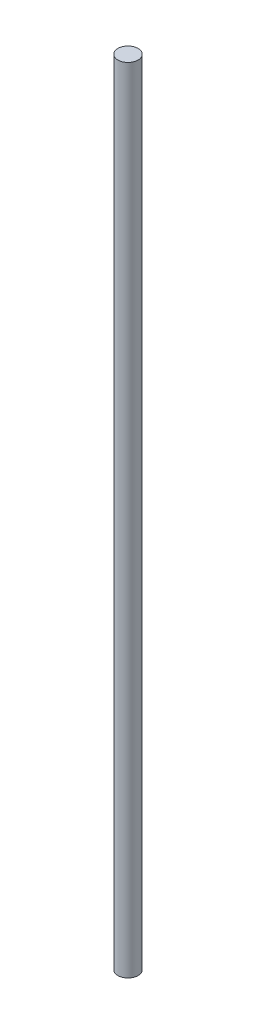
ISO-10303-21;
HEADER;
FILE_DESCRIPTION(('STEP AP214'),'2;1');
FILE_NAME('part.step','',(''),(''),'','','');
FILE_SCHEMA(('AUTOMOTIVE_DESIGN { 1 0 10303 214 1 1 1 1 }'));
ENDSEC;
DATA;
#1=APPLICATION_CONTEXT('core data for automotive mechanical design processes');
#2=APPLICATION_PROTOCOL_DEFINITION('international standard','automotive_design',2000,#1);
#3=PRODUCT_CONTEXT('',#1,'mechanical');
#4=PRODUCT('Part','Part','',(#3));
#5=PRODUCT_RELATED_PRODUCT_CATEGORY('part','',(#4));
#6=PRODUCT_DEFINITION_FORMATION('','',#4);
#7=PRODUCT_DEFINITION_CONTEXT('part definition',#1,'design');
#8=PRODUCT_DEFINITION('design','',#6,#7);
#9=PRODUCT_DEFINITION_SHAPE('','',#8);
#10=(LENGTH_UNIT() NAMED_UNIT(*) SI_UNIT(.MILLI.,.METRE.));
#11=(NAMED_UNIT(*) PLANE_ANGLE_UNIT() SI_UNIT($,.RADIAN.));
#12=(NAMED_UNIT(*) SI_UNIT($,.STERADIAN.) SOLID_ANGLE_UNIT());
#13=UNCERTAINTY_MEASURE_WITH_UNIT(LENGTH_MEASURE(1.E-05),#10,'distance_accuracy_value','');
#14=(GEOMETRIC_REPRESENTATION_CONTEXT(3) GLOBAL_UNCERTAINTY_ASSIGNED_CONTEXT((#13)) GLOBAL_UNIT_ASSIGNED_CONTEXT((#10,
#11,#12)) REPRESENTATION_CONTEXT('',''));
#15=CARTESIAN_POINT('',(0.,0.,0.));
#16=DIRECTION('',(0.,0.,1.));
#17=DIRECTION('',(1.,0.,0.));
#18=AXIS2_PLACEMENT_3D('',#15,#16,#17);
#19=CARTESIAN_POINT('',(0.,374.65,0.));
#20=DIRECTION('',(0.,-1.,0.));
#21=DIRECTION('',(0.,0.,-1.));
#22=AXIS2_PLACEMENT_3D('',#19,#20,#21);
#23=CYLINDRICAL_SURFACE('',#22,4.7625);
#24=CARTESIAN_POINT('',(0.,374.65,0.));
#25=DIRECTION('',(0.,1.,0.));
#26=DIRECTION('',(0.,0.,1.));
#27=AXIS2_PLACEMENT_3D('',#24,#25,#26);
#28=CIRCLE('',#27,4.7625);
#29=CARTESIAN_POINT('',(0.,374.65,4.7625));
#30=VERTEX_POINT('',#29);
#31=EDGE_CURVE('E10',#30,#30,#28,.T.);
#32=ORIENTED_EDGE('',*,*,#31,.F.);
#33=EDGE_LOOP('',(#32));
#34=FACE_BOUND('',#33,.T.);
#35=CARTESIAN_POINT('',(0.,0.,0.));
#36=DIRECTION('',(0.,1.,0.));
#37=DIRECTION('',(0.,0.,1.));
#38=AXIS2_PLACEMENT_3D('',#35,#36,#37);
#39=CIRCLE('',#38,4.7625);
#40=CARTESIAN_POINT('',(0.,0.,4.7625));
#41=VERTEX_POINT('',#40);
#42=EDGE_CURVE('E40',#41,#41,#39,.T.);
#43=ORIENTED_EDGE('',*,*,#42,.T.);
#44=EDGE_LOOP('',(#43));
#45=FACE_BOUND('',#44,.T.);
#46=ADVANCED_FACE('F37',(#34,#45),#23,.T.);
#47=CARTESIAN_POINT('',(0.,374.65,0.));
#48=DIRECTION('',(0.,1.,0.));
#49=DIRECTION('',(0.,0.,1.));
#50=AXIS2_PLACEMENT_3D('',#47,#48,#49);
#51=PLANE('',#50);
#52=ORIENTED_EDGE('',*,*,#31,.T.);
#53=EDGE_LOOP('',(#52));
#54=FACE_BOUND('',#53,.T.);
#55=ADVANCED_FACE('F56',(#54),#51,.T.);
#56=CARTESIAN_POINT('',(0.,0.,0.));
#57=DIRECTION('',(0.,1.,0.));
#58=DIRECTION('',(0.,0.,1.));
#59=AXIS2_PLACEMENT_3D('',#56,#57,#58);
#60=PLANE('',#59);
#61=ORIENTED_EDGE('',*,*,#42,.F.);
#62=EDGE_LOOP('',(#61));
#63=FACE_BOUND('',#62,.T.);
#64=ADVANCED_FACE('F54',(#63),#60,.F.);
#65=CLOSED_SHELL('',(#46,#55,#64));
#66=MANIFOLD_SOLID_BREP('B2',#65);
#67=ADVANCED_BREP_SHAPE_REPRESENTATION('',(#18,#66),#14);
#68=SHAPE_DEFINITION_REPRESENTATION(#9,#67);
ENDSEC;
END-ISO-10303-21;
